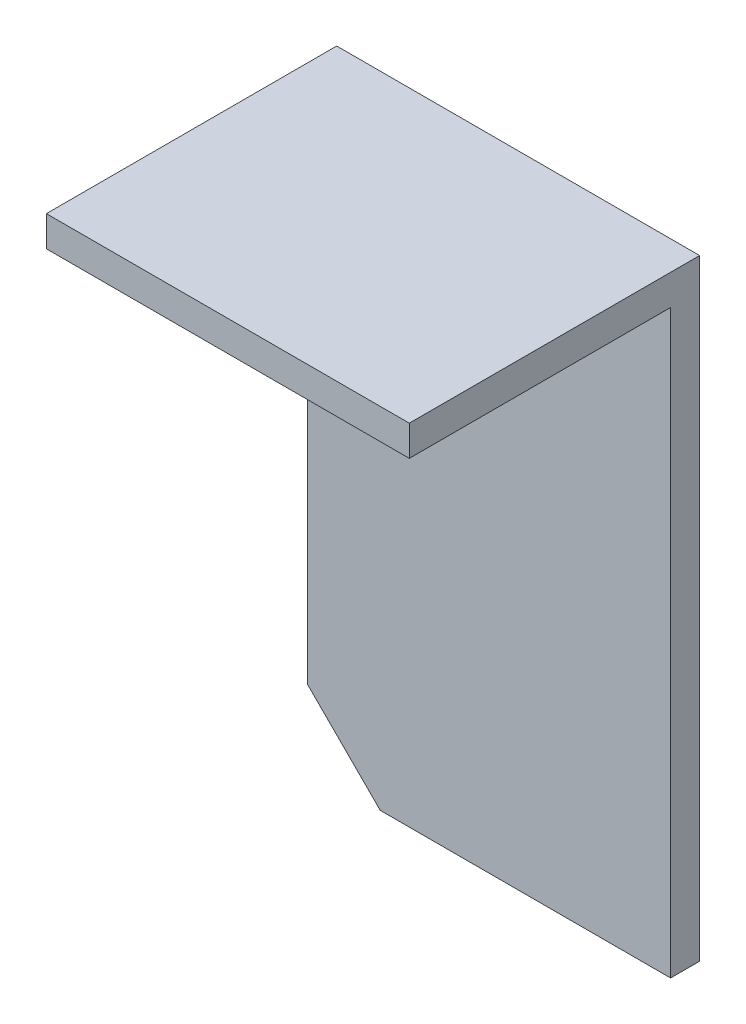
ISO-10303-21;
HEADER;
FILE_DESCRIPTION(('STEP AP214'),'2;1');
FILE_NAME('part.step','',(''),(''),'','','');
FILE_SCHEMA(('AUTOMOTIVE_DESIGN { 1 0 10303 214 1 1 1 1 }'));
ENDSEC;
DATA;
#1=APPLICATION_CONTEXT('core data for automotive mechanical design processes');
#2=APPLICATION_PROTOCOL_DEFINITION('international standard','automotive_design',2000,#1);
#3=PRODUCT_CONTEXT('',#1,'mechanical');
#4=PRODUCT('Part','Part','',(#3));
#5=PRODUCT_RELATED_PRODUCT_CATEGORY('part','',(#4));
#6=PRODUCT_DEFINITION_FORMATION('','',#4);
#7=PRODUCT_DEFINITION_CONTEXT('part definition',#1,'design');
#8=PRODUCT_DEFINITION('design','',#6,#7);
#9=PRODUCT_DEFINITION_SHAPE('','',#8);
#10=(LENGTH_UNIT() NAMED_UNIT(*) SI_UNIT(.MILLI.,.METRE.));
#11=(NAMED_UNIT(*) PLANE_ANGLE_UNIT() SI_UNIT($,.RADIAN.));
#12=(NAMED_UNIT(*) SI_UNIT($,.STERADIAN.) SOLID_ANGLE_UNIT());
#13=UNCERTAINTY_MEASURE_WITH_UNIT(LENGTH_MEASURE(1.E-05),#10,'distance_accuracy_value','');
#14=(GEOMETRIC_REPRESENTATION_CONTEXT(3) GLOBAL_UNCERTAINTY_ASSIGNED_CONTEXT((#13)) GLOBAL_UNIT_ASSIGNED_CONTEXT((#10,
#11,#12)) REPRESENTATION_CONTEXT('',''));
#15=CARTESIAN_POINT('',(0.,0.,0.));
#16=DIRECTION('',(0.,0.,1.));
#17=DIRECTION('',(1.,0.,0.));
#18=AXIS2_PLACEMENT_3D('',#15,#16,#17);
#19=CARTESIAN_POINT('',(-0.778320699595439,1.5105,0.2));
#20=DIRECTION('',(0.,0.,1.));
#21=DIRECTION('',(0.,-1.,0.));
#22=AXIS2_PLACEMENT_3D('',#19,#20,#21);
#23=PLANE('',#22);
#24=DIRECTION('',(1.,0.,0.));
#25=VECTOR('',#24,1.);
#26=CARTESIAN_POINT('',(-0.778320699595439,1.521,0.2));
#27=LINE('',#26,#25);
#28=CARTESIAN_POINT('',(-0.903320699595438,1.521,0.2));
#29=VERTEX_POINT('',#28);
#30=CARTESIAN_POINT('',(-0.653320699595441,1.521,0.2));
#31=VERTEX_POINT('',#30);
#32=EDGE_CURVE('E116',#29,#31,#27,.T.);
#33=ORIENTED_EDGE('',*,*,#32,.F.);
#34=DIRECTION('',(0.,-1.,0.));
#35=VECTOR('',#34,1.);
#36=CARTESIAN_POINT('',(-0.90332069959544,1.39066637478108,0.2));
#37=LINE('',#36,#35);
#38=CARTESIAN_POINT('',(-0.903320699595438,1.5,0.2));
#39=VERTEX_POINT('',#38);
#40=EDGE_CURVE('E158',#29,#39,#37,.T.);
#41=ORIENTED_EDGE('',*,*,#40,.T.);
#42=DIRECTION('',(1.,0.,0.));
#43=VECTOR('',#42,1.);
#44=CARTESIAN_POINT('',(-0.778320699595439,1.5,0.2));
#45=LINE('',#44,#43);
#46=CARTESIAN_POINT('',(-0.653320699595441,1.5,0.2));
#47=VERTEX_POINT('',#46);
#48=EDGE_CURVE('E11',#39,#47,#45,.T.);
#49=ORIENTED_EDGE('',*,*,#48,.T.);
#50=DIRECTION('',(0.,-1.,0.));
#51=VECTOR('',#50,1.);
#52=CARTESIAN_POINT('',(-0.653320699595439,1.36847101449275,0.2));
#53=LINE('',#52,#51);
#54=EDGE_CURVE('E120',#31,#47,#53,.T.);
#55=ORIENTED_EDGE('',*,*,#54,.F.);
#56=EDGE_LOOP('',(#33,#41,#49,#55));
#57=FACE_BOUND('',#56,.T.);
#58=ADVANCED_FACE('F16',(#57),#23,.T.);
#59=CARTESIAN_POINT('',(-0.778320699595439,1.5,0.11));
#60=DIRECTION('',(0.,1.,0.));
#61=DIRECTION('',(1.,0.,0.));
#62=AXIS2_PLACEMENT_3D('',#59,#60,#61);
#63=PLANE('',#62);
#64=DIRECTION('',(0.,0.,-1.));
#65=VECTOR('',#64,1.);
#66=CARTESIAN_POINT('',(-0.903320699595439,1.5,0.0448336252189131));
#67=LINE('',#66,#65);
#68=CARTESIAN_POINT('',(-0.903320699595438,1.5,0.02));
#69=VERTEX_POINT('',#68);
#70=EDGE_CURVE('E154',#39,#69,#67,.T.);
#71=ORIENTED_EDGE('',*,*,#70,.T.);
#72=DIRECTION('',(-1.,0.,0.));
#73=VECTOR('',#72,1.);
#74=CARTESIAN_POINT('',(-0.775032042106293,1.5,0.02));
#75=LINE('',#74,#73);
#76=CARTESIAN_POINT('',(-0.65332069959544,1.5,0.02));
#77=VERTEX_POINT('',#76);
#78=EDGE_CURVE('E26',#77,#69,#75,.T.);
#79=ORIENTED_EDGE('',*,*,#78,.F.);
#80=DIRECTION('',(0.,0.,-1.));
#81=VECTOR('',#80,1.);
#82=CARTESIAN_POINT('',(-0.653320699595439,1.5,0.0420289855072454));
#83=LINE('',#82,#81);
#84=EDGE_CURVE('E145',#47,#77,#83,.T.);
#85=ORIENTED_EDGE('',*,*,#84,.F.);
#86=ORIENTED_EDGE('',*,*,#48,.F.);
#87=EDGE_LOOP('',(#71,#79,#85,#86));
#88=FACE_BOUND('',#87,.T.);
#89=ADVANCED_FACE('F193',(#88),#63,.F.);
#90=CARTESIAN_POINT('',(-0.775032042106293,1.30501737448108,0.02));
#91=DIRECTION('',(0.,0.,1.));
#92=DIRECTION('',(0.,-1.,0.));
#93=AXIS2_PLACEMENT_3D('',#90,#91,#92);
#94=PLANE('',#93);
#95=DIRECTION('',(1.,0.,0.));
#96=VECTOR('',#95,1.);
#97=CARTESIAN_POINT('',(-0.75332069959544,1.1,0.02));
#98=LINE('',#97,#96);
#99=CARTESIAN_POINT('',(-0.853320699595439,1.1,0.02));
#100=VERTEX_POINT('',#99);
#101=CARTESIAN_POINT('',(-0.653320699595438,1.1,0.02));
#102=VERTEX_POINT('',#101);
#103=EDGE_CURVE('E168',#100,#102,#98,.T.);
#104=ORIENTED_EDGE('',*,*,#103,.T.);
#105=DIRECTION('',(0.,-1.,0.));
#106=VECTOR('',#105,1.);
#107=CARTESIAN_POINT('',(-0.653320699595439,1.36847101449275,0.02));
#108=LINE('',#107,#106);
#109=EDGE_CURVE('E143',#77,#102,#108,.T.);
#110=ORIENTED_EDGE('',*,*,#109,.F.);
#111=ORIENTED_EDGE('',*,*,#78,.T.);
#112=DIRECTION('',(0.,-1.,0.));
#113=VECTOR('',#112,1.);
#114=CARTESIAN_POINT('',(-0.903320699595439,1.39066637478108,0.02));
#115=LINE('',#114,#113);
#116=CARTESIAN_POINT('',(-0.903320699595439,1.15,0.02));
#117=VERTEX_POINT('',#116);
#118=EDGE_CURVE('E151',#69,#117,#115,.T.);
#119=ORIENTED_EDGE('',*,*,#118,.T.);
#120=DIRECTION('',(0.70710678118654,-0.707106781186555,0.));
#121=VECTOR('',#120,1.);
#122=CARTESIAN_POINT('',(-0.878320699595438,1.125,0.02));
#123=LINE('',#122,#121);
#124=EDGE_CURVE('E19',#117,#100,#123,.T.);
#125=ORIENTED_EDGE('',*,*,#124,.T.);
#126=EDGE_LOOP('',(#104,#110,#111,#119,#125));
#127=FACE_BOUND('',#126,.T.);
#128=ADVANCED_FACE('F194',(#127),#94,.T.);
#129=CARTESIAN_POINT('',(-0.878320699595438,1.125,0.01));
#130=DIRECTION('',(0.707106781186555,0.70710678118654,0.));
#131=DIRECTION('',(0.,0.,-1.));
#132=AXIS2_PLACEMENT_3D('',#129,#130,#131);
#133=PLANE('',#132);
#134=DIRECTION('',(0.,0.,1.));
#135=VECTOR('',#134,1.);
#136=CARTESIAN_POINT('',(-0.853320699595439,1.1,0.01));
#137=LINE('',#136,#135);
#138=CARTESIAN_POINT('',(-0.853320699595439,1.1,0.));
#139=VERTEX_POINT('',#138);
#140=EDGE_CURVE('E85',#139,#100,#137,.T.);
#141=ORIENTED_EDGE('',*,*,#140,.T.);
#142=ORIENTED_EDGE('',*,*,#124,.F.);
#143=DIRECTION('',(0.,0.,-1.));
#144=VECTOR('',#143,1.);
#145=CARTESIAN_POINT('',(-0.90332069959544,1.15,0.0448336252189131));
#146=LINE('',#145,#144);
#147=CARTESIAN_POINT('',(-0.903320699595439,1.15,0.));
#148=VERTEX_POINT('',#147);
#149=EDGE_CURVE('E72',#117,#148,#146,.T.);
#150=ORIENTED_EDGE('',*,*,#149,.T.);
#151=DIRECTION('',(0.707106781186544,-0.707106781186551,0.));
#152=VECTOR('',#151,1.);
#153=CARTESIAN_POINT('',(-0.903320699595439,1.15,0.));
#154=LINE('',#153,#152);
#155=EDGE_CURVE('E161',#148,#139,#154,.T.);
#156=ORIENTED_EDGE('',*,*,#155,.T.);
#157=EDGE_LOOP('',(#141,#142,#150,#156));
#158=FACE_BOUND('',#157,.T.);
#159=ADVANCED_FACE('F196',(#158),#133,.F.);
#160=CARTESIAN_POINT('',(-0.75332069959544,1.1,0.01));
#161=DIRECTION('',(0.,1.,0.));
#162=DIRECTION('',(1.,0.,0.));
#163=AXIS2_PLACEMENT_3D('',#160,#161,#162);
#164=PLANE('',#163);
#165=DIRECTION('',(0.,0.,-1.));
#166=VECTOR('',#165,1.);
#167=CARTESIAN_POINT('',(-0.653320699595438,1.1,0.0420289855072454));
#168=LINE('',#167,#166);
#169=CARTESIAN_POINT('',(-0.653320699595438,1.1,0.));
#170=VERTEX_POINT('',#169);
#171=EDGE_CURVE('E127',#102,#170,#168,.T.);
#172=ORIENTED_EDGE('',*,*,#171,.F.);
#173=ORIENTED_EDGE('',*,*,#103,.F.);
#174=ORIENTED_EDGE('',*,*,#140,.F.);
#175=DIRECTION('',(1.,0.,0.));
#176=VECTOR('',#175,1.);
#177=CARTESIAN_POINT('',(-0.775137262256358,1.1,0.));
#178=LINE('',#177,#176);
#179=EDGE_CURVE('E131',#139,#170,#178,.T.);
#180=ORIENTED_EDGE('',*,*,#179,.T.);
#181=EDGE_LOOP('',(#172,#173,#174,#180));
#182=FACE_BOUND('',#181,.T.);
#183=ADVANCED_FACE('F195',(#182),#164,.F.);
#184=CARTESIAN_POINT('',(-0.653320699595439,1.36847101449275,0.0420289855072454));
#185=DIRECTION('',(1.,0.,0.));
#186=DIRECTION('',(0.,1.,0.));
#187=AXIS2_PLACEMENT_3D('',#184,#185,#186);
#188=PLANE('',#187);
#189=DIRECTION('',(0.,0.,-1.));
#190=VECTOR('',#189,1.);
#191=CARTESIAN_POINT('',(-0.653320699595441,1.521,0.0999999999999988));
#192=LINE('',#191,#190);
#193=CARTESIAN_POINT('',(-0.65332069959544,1.521,0.));
#194=VERTEX_POINT('',#193);
#195=EDGE_CURVE('E109',#31,#194,#192,.T.);
#196=ORIENTED_EDGE('',*,*,#195,.F.);
#197=ORIENTED_EDGE('',*,*,#54,.T.);
#198=ORIENTED_EDGE('',*,*,#84,.T.);
#199=ORIENTED_EDGE('',*,*,#109,.T.);
#200=ORIENTED_EDGE('',*,*,#171,.T.);
#201=DIRECTION('',(0.,1.,0.));
#202=VECTOR('',#201,1.);
#203=CARTESIAN_POINT('',(-0.653320699595439,1.31559112123515,0.));
#204=LINE('',#203,#202);
#205=EDGE_CURVE('E123',#170,#194,#204,.T.);
#206=ORIENTED_EDGE('',*,*,#205,.T.);
#207=EDGE_LOOP('',(#196,#197,#198,#199,#200,#206));
#208=FACE_BOUND('',#207,.T.);
#209=ADVANCED_FACE('F124',(#208),#188,.T.);
#210=CARTESIAN_POINT('',(-0.778320699595439,1.521,0.0999999999999988));
#211=DIRECTION('',(0.,1.,0.));
#212=DIRECTION('',(1.,0.,0.));
#213=AXIS2_PLACEMENT_3D('',#210,#211,#212);
#214=PLANE('',#213);
#215=ORIENTED_EDGE('',*,*,#32,.T.);
#216=ORIENTED_EDGE('',*,*,#195,.T.);
#217=DIRECTION('',(-1.,0.,0.));
#218=VECTOR('',#217,1.);
#219=CARTESIAN_POINT('',(-0.775137262256358,1.521,0.));
#220=LINE('',#219,#218);
#221=CARTESIAN_POINT('',(-0.903320699595438,1.521,0.));
#222=VERTEX_POINT('',#221);
#223=EDGE_CURVE('E114',#194,#222,#220,.T.);
#224=ORIENTED_EDGE('',*,*,#223,.T.);
#225=DIRECTION('',(0.,0.,1.));
#226=VECTOR('',#225,1.);
#227=CARTESIAN_POINT('',(-0.903320699595439,1.521,0.0448336252189131));
#228=LINE('',#227,#226);
#229=EDGE_CURVE('E155',#222,#29,#228,.T.);
#230=ORIENTED_EDGE('',*,*,#229,.T.);
#231=EDGE_LOOP('',(#215,#216,#224,#230));
#232=FACE_BOUND('',#231,.T.);
#233=ADVANCED_FACE('F111',(#232),#214,.T.);
#234=CARTESIAN_POINT('',(-0.903320699595439,1.39066637478108,0.0448336252189131));
#235=DIRECTION('',(1.,0.,0.));
#236=DIRECTION('',(0.,0.,1.));
#237=AXIS2_PLACEMENT_3D('',#234,#235,#236);
#238=PLANE('',#237);
#239=ORIENTED_EDGE('',*,*,#118,.F.);
#240=ORIENTED_EDGE('',*,*,#70,.F.);
#241=ORIENTED_EDGE('',*,*,#40,.F.);
#242=ORIENTED_EDGE('',*,*,#229,.F.);
#243=DIRECTION('',(0.,-1.,0.));
#244=VECTOR('',#243,1.);
#245=CARTESIAN_POINT('',(-0.903320699595438,1.31559112123515,0.));
#246=LINE('',#245,#244);
#247=EDGE_CURVE('E136',#222,#148,#246,.T.);
#248=ORIENTED_EDGE('',*,*,#247,.T.);
#249=ORIENTED_EDGE('',*,*,#149,.F.);
#250=EDGE_LOOP('',(#239,#240,#241,#242,#248,#249));
#251=FACE_BOUND('',#250,.T.);
#252=ADVANCED_FACE('F191',(#251),#238,.F.);
#253=CARTESIAN_POINT('',(-0.775137262256358,1.31559112123515,0.));
#254=DIRECTION('',(0.,0.,1.));
#255=DIRECTION('',(0.,-1.,0.));
#256=AXIS2_PLACEMENT_3D('',#253,#254,#255);
#257=PLANE('',#256);
#258=ORIENTED_EDGE('',*,*,#223,.F.);
#259=ORIENTED_EDGE('',*,*,#205,.F.);
#260=ORIENTED_EDGE('',*,*,#179,.F.);
#261=ORIENTED_EDGE('',*,*,#155,.F.);
#262=ORIENTED_EDGE('',*,*,#247,.F.);
#263=EDGE_LOOP('',(#258,#259,#260,#261,#262));
#264=FACE_BOUND('',#263,.T.);
#265=ADVANCED_FACE('F134',(#264),#257,.F.);
#266=CLOSED_SHELL('',(#58,#89,#128,#159,#183,#209,#233,#252,#265));
#267=MANIFOLD_SOLID_BREP('B1',#266);
#268=ADVANCED_BREP_SHAPE_REPRESENTATION('',(#18,#267),#14);
#269=SHAPE_DEFINITION_REPRESENTATION(#9,#268);
ENDSEC;
END-ISO-10303-21;
